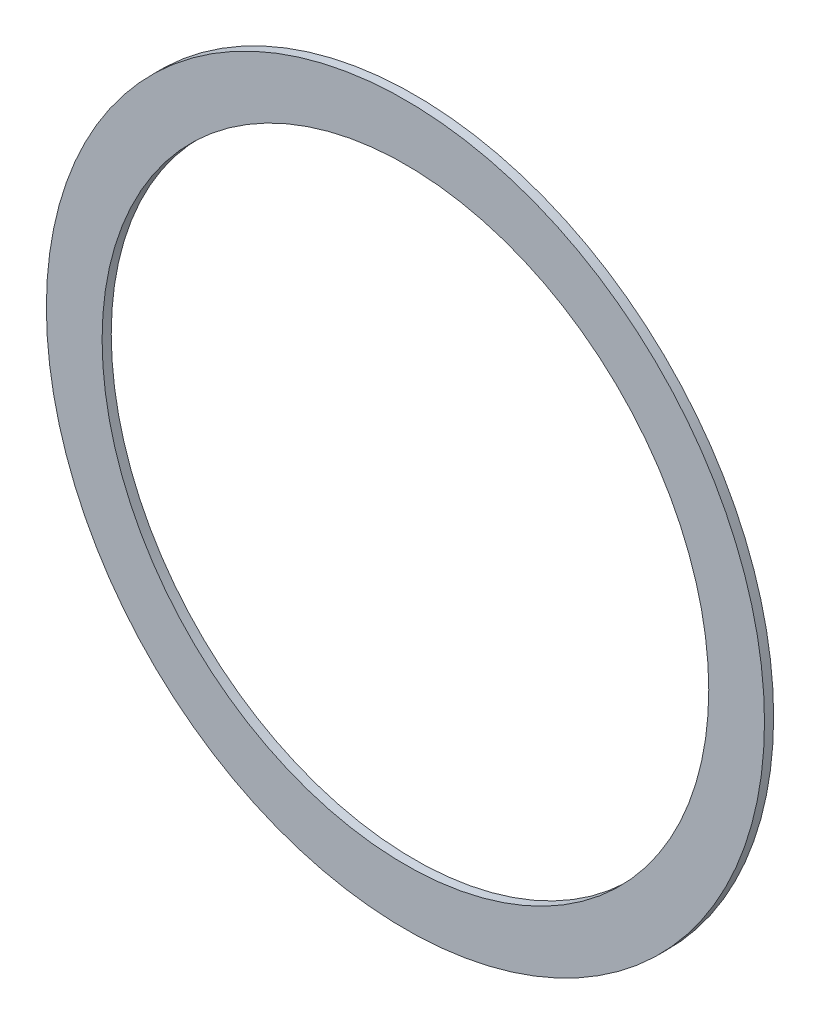
ISO-10303-21;
HEADER;
FILE_DESCRIPTION(('STEP AP214'),'2;1');
FILE_NAME('part.step','',(''),(''),'','','');
FILE_SCHEMA(('AUTOMOTIVE_DESIGN { 1 0 10303 214 1 1 1 1 }'));
ENDSEC;
DATA;
#1=APPLICATION_CONTEXT('core data for automotive mechanical design processes');
#2=APPLICATION_PROTOCOL_DEFINITION('international standard','automotive_design',2000,#1);
#3=PRODUCT_CONTEXT('',#1,'mechanical');
#4=PRODUCT('Part','Part','',(#3));
#5=PRODUCT_RELATED_PRODUCT_CATEGORY('part','',(#4));
#6=PRODUCT_DEFINITION_FORMATION('','',#4);
#7=PRODUCT_DEFINITION_CONTEXT('part definition',#1,'design');
#8=PRODUCT_DEFINITION('design','',#6,#7);
#9=PRODUCT_DEFINITION_SHAPE('','',#8);
#10=(LENGTH_UNIT() NAMED_UNIT(*) SI_UNIT(.MILLI.,.METRE.));
#11=(NAMED_UNIT(*) PLANE_ANGLE_UNIT() SI_UNIT($,.RADIAN.));
#12=(NAMED_UNIT(*) SI_UNIT($,.STERADIAN.) SOLID_ANGLE_UNIT());
#13=UNCERTAINTY_MEASURE_WITH_UNIT(LENGTH_MEASURE(1.E-05),#10,'distance_accuracy_value','');
#14=(GEOMETRIC_REPRESENTATION_CONTEXT(3) GLOBAL_UNCERTAINTY_ASSIGNED_CONTEXT((#13)) GLOBAL_UNIT_ASSIGNED_CONTEXT((#10,
#11,#12)) REPRESENTATION_CONTEXT('',''));
#15=CARTESIAN_POINT('',(0.,0.,0.));
#16=DIRECTION('',(0.,0.,1.));
#17=DIRECTION('',(1.,0.,0.));
#18=AXIS2_PLACEMENT_3D('',#15,#16,#17);
#19=CARTESIAN_POINT('',(0.,0.,1.));
#20=DIRECTION('',(0.,0.,1.));
#21=DIRECTION('',(1.,0.,0.));
#22=AXIS2_PLACEMENT_3D('',#19,#20,#21);
#23=PLANE('',#22);
#24=CARTESIAN_POINT('',(0.,0.,1.));
#25=DIRECTION('',(0.,0.,1.));
#26=DIRECTION('',(1.,0.,0.));
#27=AXIS2_PLACEMENT_3D('',#24,#25,#26);
#28=CIRCLE('',#27,39.3);
#29=CARTESIAN_POINT('',(39.3,0.,1.));
#30=VERTEX_POINT('',#29);
#31=EDGE_CURVE('E10',#30,#30,#28,.T.);
#32=ORIENTED_EDGE('',*,*,#31,.T.);
#33=EDGE_LOOP('',(#32));
#34=FACE_BOUND('',#33,.T.);
#35=CARTESIAN_POINT('',(0.,0.,1.));
#36=DIRECTION('',(0.,0.,1.));
#37=DIRECTION('',(1.,0.,0.));
#38=AXIS2_PLACEMENT_3D('',#35,#36,#37);
#39=CIRCLE('',#38,33.2);
#40=CARTESIAN_POINT('',(33.2,0.,1.));
#41=VERTEX_POINT('',#40);
#42=EDGE_CURVE('E50',#41,#41,#39,.T.);
#43=ORIENTED_EDGE('',*,*,#42,.F.);
#44=EDGE_LOOP('',(#43));
#45=FACE_BOUND('',#44,.T.);
#46=ADVANCED_FACE('F37',(#34,#45),#23,.T.);
#47=CARTESIAN_POINT('',(0.,0.,0.));
#48=DIRECTION('',(0.,0.,1.));
#49=DIRECTION('',(1.,0.,0.));
#50=AXIS2_PLACEMENT_3D('',#47,#48,#49);
#51=PLANE('',#50);
#52=CARTESIAN_POINT('',(0.,0.,0.));
#53=DIRECTION('',(0.,0.,1.));
#54=DIRECTION('',(1.,0.,0.));
#55=AXIS2_PLACEMENT_3D('',#52,#53,#54);
#56=CIRCLE('',#55,39.3);
#57=CARTESIAN_POINT('',(39.3,0.,0.));
#58=VERTEX_POINT('',#57);
#59=EDGE_CURVE('E41',#58,#58,#56,.T.);
#60=ORIENTED_EDGE('',*,*,#59,.F.);
#61=EDGE_LOOP('',(#60));
#62=FACE_BOUND('',#61,.T.);
#63=CARTESIAN_POINT('',(0.,0.,0.));
#64=DIRECTION('',(0.,0.,1.));
#65=DIRECTION('',(1.,0.,0.));
#66=AXIS2_PLACEMENT_3D('',#63,#64,#65);
#67=CIRCLE('',#66,33.2);
#68=CARTESIAN_POINT('',(33.2,0.,0.));
#69=VERTEX_POINT('',#68);
#70=EDGE_CURVE('E52',#69,#69,#67,.T.);
#71=ORIENTED_EDGE('',*,*,#70,.T.);
#72=EDGE_LOOP('',(#71));
#73=FACE_BOUND('',#72,.T.);
#74=ADVANCED_FACE('F64',(#62,#73),#51,.F.);
#75=CARTESIAN_POINT('',(0.,0.,1.));
#76=DIRECTION('',(0.,0.,-1.));
#77=DIRECTION('',(-1.,0.,0.));
#78=AXIS2_PLACEMENT_3D('',#75,#76,#77);
#79=CYLINDRICAL_SURFACE('',#78,39.3);
#80=ORIENTED_EDGE('',*,*,#31,.F.);
#81=EDGE_LOOP('',(#80));
#82=FACE_BOUND('',#81,.T.);
#83=ORIENTED_EDGE('',*,*,#59,.T.);
#84=EDGE_LOOP('',(#83));
#85=FACE_BOUND('',#84,.T.);
#86=ADVANCED_FACE('F39',(#82,#85),#79,.T.);
#87=CARTESIAN_POINT('',(0.,0.,1.));
#88=DIRECTION('',(0.,0.,-1.));
#89=DIRECTION('',(-1.,0.,0.));
#90=AXIS2_PLACEMENT_3D('',#87,#88,#89);
#91=CYLINDRICAL_SURFACE('',#90,33.2);
#92=ORIENTED_EDGE('',*,*,#42,.T.);
#93=EDGE_LOOP('',(#92));
#94=FACE_BOUND('',#93,.T.);
#95=ORIENTED_EDGE('',*,*,#70,.F.);
#96=EDGE_LOOP('',(#95));
#97=FACE_BOUND('',#96,.T.);
#98=ADVANCED_FACE('F60',(#94,#97),#91,.F.);
#99=CLOSED_SHELL('',(#46,#74,#86,#98));
#100=MANIFOLD_SOLID_BREP('B2',#99);
#101=ADVANCED_BREP_SHAPE_REPRESENTATION('',(#18,#100),#14);
#102=SHAPE_DEFINITION_REPRESENTATION(#9,#101);
ENDSEC;
END-ISO-10303-21;
